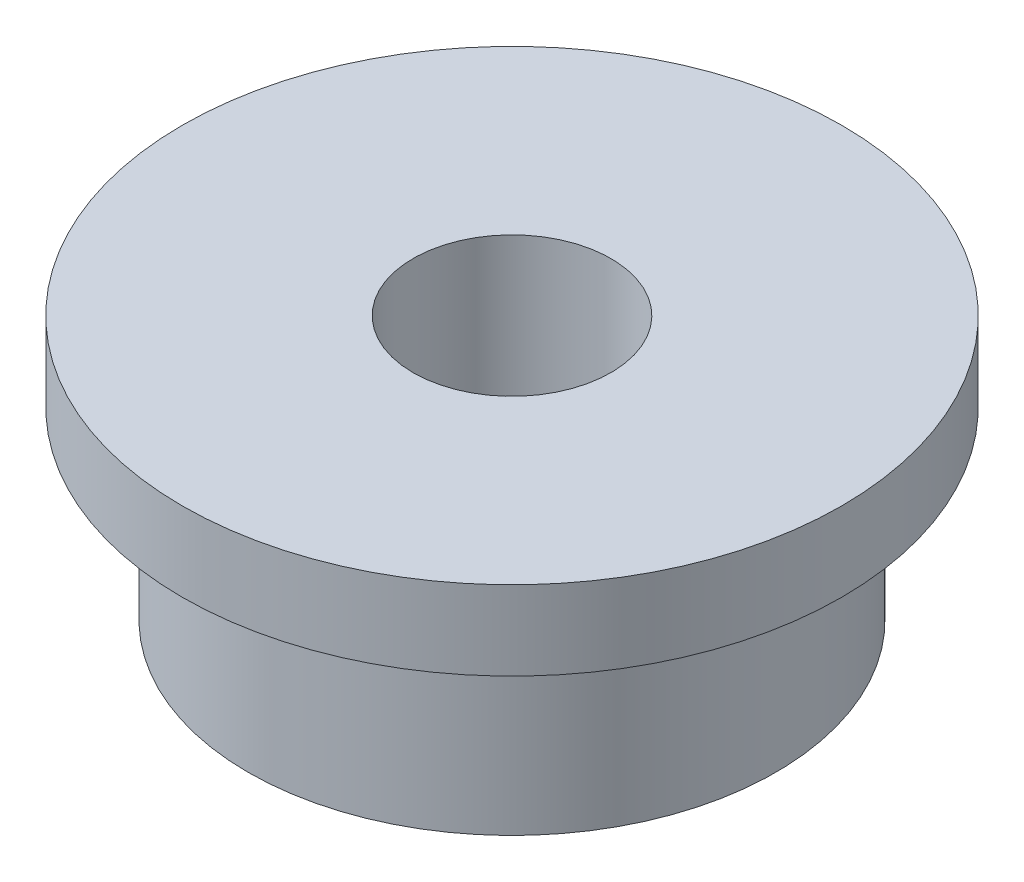
ISO-10303-21;
HEADER;
FILE_DESCRIPTION(('STEP AP214'),'2;1');
FILE_NAME('part.step','',(''),(''),'','','');
FILE_SCHEMA(('AUTOMOTIVE_DESIGN { 1 0 10303 214 1 1 1 1 }'));
ENDSEC;
DATA;
#1=APPLICATION_CONTEXT('core data for automotive mechanical design processes');
#2=APPLICATION_PROTOCOL_DEFINITION('international standard','automotive_design',2000,#1);
#3=PRODUCT_CONTEXT('',#1,'mechanical');
#4=PRODUCT('Part','Part','',(#3));
#5=PRODUCT_RELATED_PRODUCT_CATEGORY('part','',(#4));
#6=PRODUCT_DEFINITION_FORMATION('','',#4);
#7=PRODUCT_DEFINITION_CONTEXT('part definition',#1,'design');
#8=PRODUCT_DEFINITION('design','',#6,#7);
#9=PRODUCT_DEFINITION_SHAPE('','',#8);
#10=(LENGTH_UNIT() NAMED_UNIT(*) SI_UNIT(.MILLI.,.METRE.));
#11=(NAMED_UNIT(*) PLANE_ANGLE_UNIT() SI_UNIT($,.RADIAN.));
#12=(NAMED_UNIT(*) SI_UNIT($,.STERADIAN.) SOLID_ANGLE_UNIT());
#13=UNCERTAINTY_MEASURE_WITH_UNIT(LENGTH_MEASURE(1.E-05),#10,'distance_accuracy_value','');
#14=(GEOMETRIC_REPRESENTATION_CONTEXT(3) GLOBAL_UNCERTAINTY_ASSIGNED_CONTEXT((#13)) GLOBAL_UNIT_ASSIGNED_CONTEXT((#10,
#11,#12)) REPRESENTATION_CONTEXT('',''));
#15=CARTESIAN_POINT('',(0.,0.,0.));
#16=DIRECTION('',(0.,0.,1.));
#17=DIRECTION('',(1.,0.,0.));
#18=AXIS2_PLACEMENT_3D('',#15,#16,#17);
#19=CARTESIAN_POINT('',(0.,2.,0.));
#20=DIRECTION('',(0.,-1.,0.));
#21=DIRECTION('',(0.,0.,-1.));
#22=AXIS2_PLACEMENT_3D('',#19,#20,#21);
#23=CYLINDRICAL_SURFACE('',#22,2.);
#24=CARTESIAN_POINT('',(0.,0.,0.));
#25=DIRECTION('',(0.,1.,0.));
#26=DIRECTION('',(0.,0.,1.));
#27=AXIS2_PLACEMENT_3D('',#24,#25,#26);
#28=CIRCLE('',#27,2.);
#29=CARTESIAN_POINT('',(0.,0.,2.));
#30=VERTEX_POINT('',#29);
#31=EDGE_CURVE('E38',#30,#30,#28,.T.);
#32=ORIENTED_EDGE('',*,*,#31,.T.);
#33=EDGE_LOOP('',(#32));
#34=FACE_BOUND('',#33,.T.);
#35=CARTESIAN_POINT('',(0.,1.4,0.));
#36=DIRECTION('',(0.,1.,0.));
#37=DIRECTION('',(0.,0.,1.));
#38=AXIS2_PLACEMENT_3D('',#35,#36,#37);
#39=CIRCLE('',#38,2.);
#40=CARTESIAN_POINT('',(0.,1.4,2.));
#41=VERTEX_POINT('',#40);
#42=EDGE_CURVE('E10',#41,#41,#39,.T.);
#43=ORIENTED_EDGE('',*,*,#42,.F.);
#44=EDGE_LOOP('',(#43));
#45=FACE_BOUND('',#44,.T.);
#46=ADVANCED_FACE('F32',(#34,#45),#23,.T.);
#47=CARTESIAN_POINT('',(0.,2.,0.));
#48=DIRECTION('',(0.,1.,0.));
#49=DIRECTION('',(0.,0.,1.));
#50=AXIS2_PLACEMENT_3D('',#47,#48,#49);
#51=PLANE('',#50);
#52=CARTESIAN_POINT('',(0.,2.,0.));
#53=DIRECTION('',(0.,1.,0.));
#54=DIRECTION('',(0.,0.,1.));
#55=AXIS2_PLACEMENT_3D('',#52,#53,#54);
#56=CIRCLE('',#55,0.75);
#57=CARTESIAN_POINT('',(0.,2.,0.75));
#58=VERTEX_POINT('',#57);
#59=EDGE_CURVE('E42',#58,#58,#56,.T.);
#60=ORIENTED_EDGE('',*,*,#59,.F.);
#61=EDGE_LOOP('',(#60));
#62=FACE_BOUND('',#61,.T.);
#63=CARTESIAN_POINT('',(0.,2.,0.));
#64=DIRECTION('',(0.,1.,0.));
#65=DIRECTION('',(0.,0.,1.));
#66=AXIS2_PLACEMENT_3D('',#63,#64,#65);
#67=CIRCLE('',#66,2.5);
#68=CARTESIAN_POINT('',(0.,2.,2.5));
#69=VERTEX_POINT('',#68);
#70=EDGE_CURVE('E52',#69,#69,#67,.T.);
#71=ORIENTED_EDGE('',*,*,#70,.T.);
#72=EDGE_LOOP('',(#71));
#73=FACE_BOUND('',#72,.T.);
#74=ADVANCED_FACE('F70',(#62,#73),#51,.T.);
#75=CARTESIAN_POINT('',(0.,0.,0.));
#76=DIRECTION('',(0.,1.,0.));
#77=DIRECTION('',(0.,0.,1.));
#78=AXIS2_PLACEMENT_3D('',#75,#76,#77);
#79=PLANE('',#78);
#80=ORIENTED_EDGE('',*,*,#31,.F.);
#81=EDGE_LOOP('',(#80));
#82=FACE_BOUND('',#81,.T.);
#83=CARTESIAN_POINT('',(0.,0.,0.));
#84=DIRECTION('',(0.,1.,0.));
#85=DIRECTION('',(0.,0.,1.));
#86=AXIS2_PLACEMENT_3D('',#83,#84,#85);
#87=CIRCLE('',#86,0.75);
#88=CARTESIAN_POINT('',(0.,0.,0.75));
#89=VERTEX_POINT('',#88);
#90=EDGE_CURVE('E46',#89,#89,#87,.T.);
#91=ORIENTED_EDGE('',*,*,#90,.T.);
#92=EDGE_LOOP('',(#91));
#93=FACE_BOUND('',#92,.T.);
#94=ADVANCED_FACE('F74',(#82,#93),#79,.F.);
#95=CARTESIAN_POINT('',(0.,2.,0.));
#96=DIRECTION('',(0.,-1.,0.));
#97=DIRECTION('',(0.,0.,-1.));
#98=AXIS2_PLACEMENT_3D('',#95,#96,#97);
#99=CYLINDRICAL_SURFACE('',#98,0.75);
#100=ORIENTED_EDGE('',*,*,#59,.T.);
#101=EDGE_LOOP('',(#100));
#102=FACE_BOUND('',#101,.T.);
#103=ORIENTED_EDGE('',*,*,#90,.F.);
#104=EDGE_LOOP('',(#103));
#105=FACE_BOUND('',#104,.T.);
#106=ADVANCED_FACE('F67',(#102,#105),#99,.F.);
#107=CARTESIAN_POINT('',(0.,1.4,0.));
#108=DIRECTION('',(0.,1.,0.));
#109=DIRECTION('',(0.,0.,1.));
#110=AXIS2_PLACEMENT_3D('',#107,#108,#109);
#111=CYLINDRICAL_SURFACE('',#110,2.5);
#112=CARTESIAN_POINT('',(0.,1.4,0.));
#113=DIRECTION('',(0.,1.,0.));
#114=DIRECTION('',(0.,0.,1.));
#115=AXIS2_PLACEMENT_3D('',#112,#113,#114);
#116=CIRCLE('',#115,2.5);
#117=CARTESIAN_POINT('',(0.,1.4,2.5));
#118=VERTEX_POINT('',#117);
#119=EDGE_CURVE('E50',#118,#118,#116,.T.);
#120=ORIENTED_EDGE('',*,*,#119,.T.);
#121=EDGE_LOOP('',(#120));
#122=FACE_BOUND('',#121,.T.);
#123=ORIENTED_EDGE('',*,*,#70,.F.);
#124=EDGE_LOOP('',(#123));
#125=FACE_BOUND('',#124,.T.);
#126=ADVANCED_FACE('F58',(#122,#125),#111,.T.);
#127=CARTESIAN_POINT('',(0.,1.4,0.));
#128=DIRECTION('',(0.,1.,0.));
#129=DIRECTION('',(0.,0.,1.));
#130=AXIS2_PLACEMENT_3D('',#127,#128,#129);
#131=PLANE('',#130);
#132=ORIENTED_EDGE('',*,*,#42,.T.);
#133=EDGE_LOOP('',(#132));
#134=FACE_BOUND('',#133,.T.);
#135=ORIENTED_EDGE('',*,*,#119,.F.);
#136=EDGE_LOOP('',(#135));
#137=FACE_BOUND('',#136,.T.);
#138=ADVANCED_FACE('F61',(#134,#137),#131,.F.);
#139=CLOSED_SHELL('',(#46,#74,#94,#106,#126,#138));
#140=MANIFOLD_SOLID_BREP('B2',#139);
#141=ADVANCED_BREP_SHAPE_REPRESENTATION('',(#18,#140),#14);
#142=SHAPE_DEFINITION_REPRESENTATION(#9,#141);
ENDSEC;
END-ISO-10303-21;
